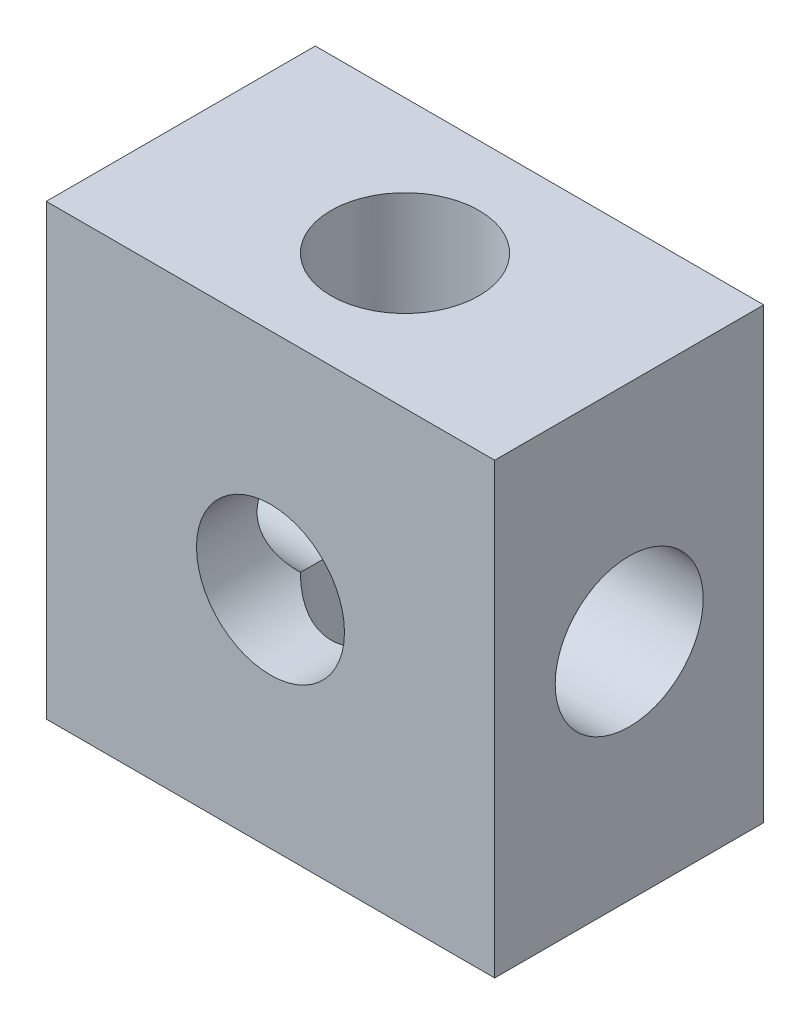
ISO-10303-21;
HEADER;
FILE_DESCRIPTION(('STEP AP214'),'2;1');
FILE_NAME('part.step','',(''),(''),'','','');
FILE_SCHEMA(('AUTOMOTIVE_DESIGN { 1 0 10303 214 1 1 1 1 }'));
ENDSEC;
DATA;
#1=APPLICATION_CONTEXT('core data for automotive mechanical design processes');
#2=APPLICATION_PROTOCOL_DEFINITION('international standard','automotive_design',2000,#1);
#3=PRODUCT_CONTEXT('',#1,'mechanical');
#4=PRODUCT('Part','Part','',(#3));
#5=PRODUCT_RELATED_PRODUCT_CATEGORY('part','',(#4));
#6=PRODUCT_DEFINITION_FORMATION('','',#4);
#7=PRODUCT_DEFINITION_CONTEXT('part definition',#1,'design');
#8=PRODUCT_DEFINITION('design','',#6,#7);
#9=PRODUCT_DEFINITION_SHAPE('','',#8);
#10=(LENGTH_UNIT() NAMED_UNIT(*) SI_UNIT(.MILLI.,.METRE.));
#11=(NAMED_UNIT(*) PLANE_ANGLE_UNIT() SI_UNIT($,.RADIAN.));
#12=(NAMED_UNIT(*) SI_UNIT($,.STERADIAN.) SOLID_ANGLE_UNIT());
#13=UNCERTAINTY_MEASURE_WITH_UNIT(LENGTH_MEASURE(1.E-05),#10,'distance_accuracy_value','');
#14=(GEOMETRIC_REPRESENTATION_CONTEXT(3) GLOBAL_UNCERTAINTY_ASSIGNED_CONTEXT((#13)) GLOBAL_UNIT_ASSIGNED_CONTEXT((#10,
#11,#12)) REPRESENTATION_CONTEXT('',''));
#15=CARTESIAN_POINT('',(0.,0.,0.));
#16=DIRECTION('',(0.,0.,1.));
#17=DIRECTION('',(1.,0.,0.));
#18=AXIS2_PLACEMENT_3D('',#15,#16,#17);
#19=CARTESIAN_POINT('',(0.,0.,0.));
#20=DIRECTION('',(0.,0.,1.));
#21=DIRECTION('',(1.,0.,0.));
#22=AXIS2_PLACEMENT_3D('',#19,#20,#21);
#23=CYLINDRICAL_SURFACE('',#22,1.65);
#24=CARTESIAN_POINT('',(0.,0.,6.));
#25=DIRECTION('',(0.,0.,1.));
#26=DIRECTION('',(1.,0.,0.));
#27=AXIS2_PLACEMENT_3D('',#24,#25,#26);
#28=CIRCLE('',#27,1.65);
#29=CARTESIAN_POINT('',(1.65,0.,6.));
#30=VERTEX_POINT('',#29);
#31=EDGE_CURVE('E141',#30,#30,#28,.T.);
#32=ORIENTED_EDGE('',*,*,#31,.T.);
#33=EDGE_LOOP('',(#32));
#34=FACE_BOUND('',#33,.T.);
#35=CARTESIAN_POINT('',(0.,0.,3.));
#36=DIRECTION('',(-0.707106781186547,0.,0.707106781186547));
#37=DIRECTION('',(0.707106781186547,0.,0.707106781186547));
#38=AXIS2_PLACEMENT_3D('',#35,#36,#37);
#39=ELLIPSE('',#38,2.33345237791561,1.65);
#40=CARTESIAN_POINT('',(1.1667261889578,1.1667261889578,4.1667261889578));
#41=VERTEX_POINT('',#40);
#42=CARTESIAN_POINT('',(1.1667261889578,-1.1667261889578,4.1667261889578));
#43=VERTEX_POINT('',#42);
#44=EDGE_CURVE('E103',#41,#43,#39,.F.);
#45=ORIENTED_EDGE('',*,*,#44,.T.);
#46=CARTESIAN_POINT('',(0.,0.,3.));
#47=DIRECTION('',(0.,0.707106781186547,0.707106781186547));
#48=DIRECTION('',(0.,-0.707106781186547,0.707106781186547));
#49=AXIS2_PLACEMENT_3D('',#46,#47,#48);
#50=ELLIPSE('',#49,2.33345237791561,1.65);
#51=CARTESIAN_POINT('',(-1.1667261889578,-1.1667261889578,4.1667261889578));
#52=VERTEX_POINT('',#51);
#53=EDGE_CURVE('E49',#43,#52,#50,.F.);
#54=ORIENTED_EDGE('',*,*,#53,.T.);
#55=CARTESIAN_POINT('',(0.,0.,3.));
#56=DIRECTION('',(0.707106781186547,0.,0.707106781186547));
#57=DIRECTION('',(-0.707106781186547,0.,0.707106781186547));
#58=AXIS2_PLACEMENT_3D('',#55,#56,#57);
#59=ELLIPSE('',#58,2.33345237791561,1.65);
#60=CARTESIAN_POINT('',(-1.1667261889578,1.1667261889578,4.1667261889578));
#61=VERTEX_POINT('',#60);
#62=EDGE_CURVE('E115',#52,#61,#59,.F.);
#63=ORIENTED_EDGE('',*,*,#62,.T.);
#64=CARTESIAN_POINT('',(0.,0.,3.));
#65=DIRECTION('',(0.,-0.707106781186547,0.707106781186547));
#66=DIRECTION('',(0.,0.707106781186547,0.707106781186547));
#67=AXIS2_PLACEMENT_3D('',#64,#65,#66);
#68=ELLIPSE('',#67,2.33345237791561,1.65);
#69=EDGE_CURVE('E126',#61,#41,#68,.F.);
#70=ORIENTED_EDGE('',*,*,#69,.T.);
#71=EDGE_LOOP('',(#45,#54,#63,#70));
#72=FACE_BOUND('',#71,.T.);
#73=ADVANCED_FACE('F34',(#34,#72),#23,.F.);
#74=CARTESIAN_POINT('',(5.,5.,6.));
#75=DIRECTION('',(-1.,0.,0.));
#76=DIRECTION('',(0.,-1.,0.));
#77=AXIS2_PLACEMENT_3D('',#74,#75,#76);
#78=PLANE('',#77);
#79=CARTESIAN_POINT('',(5.,0.,3.));
#80=DIRECTION('',(-1.,0.,0.));
#81=DIRECTION('',(0.,0.,1.));
#82=AXIS2_PLACEMENT_3D('',#79,#80,#81);
#83=CIRCLE('',#82,1.65);
#84=CARTESIAN_POINT('',(5.,0.,4.65));
#85=VERTEX_POINT('',#84);
#86=EDGE_CURVE('E130',#85,#85,#83,.T.);
#87=ORIENTED_EDGE('',*,*,#86,.T.);
#88=EDGE_LOOP('',(#87));
#89=FACE_BOUND('',#88,.T.);
#90=DIRECTION('',(0.,1.,0.));
#91=VECTOR('',#90,1.);
#92=CARTESIAN_POINT('',(5.,5.,0.));
#93=LINE('',#92,#91);
#94=CARTESIAN_POINT('',(5.,-5.,0.));
#95=VERTEX_POINT('',#94);
#96=CARTESIAN_POINT('',(5.,5.,0.));
#97=VERTEX_POINT('',#96);
#98=EDGE_CURVE('E145',#95,#97,#93,.T.);
#99=ORIENTED_EDGE('',*,*,#98,.T.);
#100=DIRECTION('',(0.,0.,-1.));
#101=VECTOR('',#100,1.);
#102=CARTESIAN_POINT('',(5.,5.,6.));
#103=LINE('',#102,#101);
#104=CARTESIAN_POINT('',(5.,5.,6.));
#105=VERTEX_POINT('',#104);
#106=EDGE_CURVE('E119',#105,#97,#103,.T.);
#107=ORIENTED_EDGE('',*,*,#106,.F.);
#108=DIRECTION('',(0.,1.,0.));
#109=VECTOR('',#108,1.);
#110=CARTESIAN_POINT('',(5.,5.,6.));
#111=LINE('',#110,#109);
#112=CARTESIAN_POINT('',(5.,-5.,6.));
#113=VERTEX_POINT('',#112);
#114=EDGE_CURVE('E148',#113,#105,#111,.T.);
#115=ORIENTED_EDGE('',*,*,#114,.F.);
#116=DIRECTION('',(0.,0.,-1.));
#117=VECTOR('',#116,1.);
#118=CARTESIAN_POINT('',(5.,-5.,6.));
#119=LINE('',#118,#117);
#120=EDGE_CURVE('E158',#113,#95,#119,.T.);
#121=ORIENTED_EDGE('',*,*,#120,.T.);
#122=EDGE_LOOP('',(#99,#107,#115,#121));
#123=FACE_BOUND('',#122,.T.);
#124=ADVANCED_FACE('F36',(#89,#123),#78,.F.);
#125=CARTESIAN_POINT('',(-5.,5.,6.));
#126=DIRECTION('',(0.,-1.,0.));
#127=DIRECTION('',(1.,0.,0.));
#128=AXIS2_PLACEMENT_3D('',#125,#126,#127);
#129=PLANE('',#128);
#130=CARTESIAN_POINT('',(0.,5.,3.));
#131=DIRECTION('',(0.,1.,0.));
#132=DIRECTION('',(-1.,0.,0.));
#133=AXIS2_PLACEMENT_3D('',#130,#131,#132);
#134=CIRCLE('',#133,1.65);
#135=CARTESIAN_POINT('',(-1.65,5.,3.));
#136=VERTEX_POINT('',#135);
#137=EDGE_CURVE('E236',#136,#136,#134,.T.);
#138=ORIENTED_EDGE('',*,*,#137,.F.);
#139=EDGE_LOOP('',(#138));
#140=FACE_BOUND('',#139,.T.);
#141=DIRECTION('',(-1.,0.,0.));
#142=VECTOR('',#141,1.);
#143=CARTESIAN_POINT('',(-5.,5.,0.));
#144=LINE('',#143,#142);
#145=CARTESIAN_POINT('',(-5.,5.,0.));
#146=VERTEX_POINT('',#145);
#147=EDGE_CURVE('E161',#97,#146,#144,.T.);
#148=ORIENTED_EDGE('',*,*,#147,.T.);
#149=DIRECTION('',(0.,0.,-1.));
#150=VECTOR('',#149,1.);
#151=CARTESIAN_POINT('',(-5.,5.,6.));
#152=LINE('',#151,#150);
#153=CARTESIAN_POINT('',(-5.,5.,6.));
#154=VERTEX_POINT('',#153);
#155=EDGE_CURVE('E171',#154,#146,#152,.T.);
#156=ORIENTED_EDGE('',*,*,#155,.F.);
#157=DIRECTION('',(-1.,0.,0.));
#158=VECTOR('',#157,1.);
#159=CARTESIAN_POINT('',(-5.,5.,6.));
#160=LINE('',#159,#158);
#161=EDGE_CURVE('E151',#105,#154,#160,.T.);
#162=ORIENTED_EDGE('',*,*,#161,.F.);
#163=ORIENTED_EDGE('',*,*,#106,.T.);
#164=EDGE_LOOP('',(#148,#156,#162,#163));
#165=FACE_BOUND('',#164,.T.);
#166=ADVANCED_FACE('F176',(#140,#165),#129,.F.);
#167=CARTESIAN_POINT('',(-5.,5.,6.));
#168=DIRECTION('',(1.,0.,0.));
#169=DIRECTION('',(0.,0.,-1.));
#170=AXIS2_PLACEMENT_3D('',#167,#168,#169);
#171=PLANE('',#170);
#172=CARTESIAN_POINT('',(-5.,0.,3.));
#173=DIRECTION('',(1.,0.,0.));
#174=DIRECTION('',(0.,0.,-1.));
#175=AXIS2_PLACEMENT_3D('',#172,#173,#174);
#176=CIRCLE('',#175,1.65);
#177=CARTESIAN_POINT('',(-5.,0.,1.35));
#178=VERTEX_POINT('',#177);
#179=EDGE_CURVE('E138',#178,#178,#176,.T.);
#180=ORIENTED_EDGE('',*,*,#179,.T.);
#181=EDGE_LOOP('',(#180));
#182=FACE_BOUND('',#181,.T.);
#183=DIRECTION('',(0.,-1.,0.));
#184=VECTOR('',#183,1.);
#185=CARTESIAN_POINT('',(-5.,5.,0.));
#186=LINE('',#185,#184);
#187=CARTESIAN_POINT('',(-5.,-5.,0.));
#188=VERTEX_POINT('',#187);
#189=EDGE_CURVE('E163',#146,#188,#186,.T.);
#190=ORIENTED_EDGE('',*,*,#189,.T.);
#191=DIRECTION('',(0.,0.,-1.));
#192=VECTOR('',#191,1.);
#193=CARTESIAN_POINT('',(-5.,-5.,6.));
#194=LINE('',#193,#192);
#195=CARTESIAN_POINT('',(-5.,-5.,6.));
#196=VERTEX_POINT('',#195);
#197=EDGE_CURVE('E168',#196,#188,#194,.T.);
#198=ORIENTED_EDGE('',*,*,#197,.F.);
#199=DIRECTION('',(0.,-1.,0.));
#200=VECTOR('',#199,1.);
#201=CARTESIAN_POINT('',(-5.,5.,6.));
#202=LINE('',#201,#200);
#203=EDGE_CURVE('E154',#154,#196,#202,.T.);
#204=ORIENTED_EDGE('',*,*,#203,.F.);
#205=ORIENTED_EDGE('',*,*,#155,.T.);
#206=EDGE_LOOP('',(#190,#198,#204,#205));
#207=FACE_BOUND('',#206,.T.);
#208=ADVANCED_FACE('F188',(#182,#207),#171,.F.);
#209=CARTESIAN_POINT('',(-5.,-5.,6.));
#210=DIRECTION('',(0.,1.,0.));
#211=DIRECTION('',(-1.,0.,0.));
#212=AXIS2_PLACEMENT_3D('',#209,#210,#211);
#213=PLANE('',#212);
#214=CARTESIAN_POINT('',(0.,-5.,3.));
#215=DIRECTION('',(0.,1.,0.));
#216=DIRECTION('',(-1.,0.,0.));
#217=AXIS2_PLACEMENT_3D('',#214,#215,#216);
#218=CIRCLE('',#217,1.65);
#219=CARTESIAN_POINT('',(-1.65,-5.,3.));
#220=VERTEX_POINT('',#219);
#221=EDGE_CURVE('E112',#220,#220,#218,.T.);
#222=ORIENTED_EDGE('',*,*,#221,.T.);
#223=EDGE_LOOP('',(#222));
#224=FACE_BOUND('',#223,.T.);
#225=DIRECTION('',(1.,0.,0.));
#226=VECTOR('',#225,1.);
#227=CARTESIAN_POINT('',(-5.,-5.,0.));
#228=LINE('',#227,#226);
#229=EDGE_CURVE('E152',#188,#95,#228,.T.);
#230=ORIENTED_EDGE('',*,*,#229,.T.);
#231=ORIENTED_EDGE('',*,*,#120,.F.);
#232=DIRECTION('',(1.,0.,0.));
#233=VECTOR('',#232,1.);
#234=CARTESIAN_POINT('',(-5.,-5.,6.));
#235=LINE('',#234,#233);
#236=EDGE_CURVE('E156',#196,#113,#235,.T.);
#237=ORIENTED_EDGE('',*,*,#236,.F.);
#238=ORIENTED_EDGE('',*,*,#197,.T.);
#239=EDGE_LOOP('',(#230,#231,#237,#238));
#240=FACE_BOUND('',#239,.T.);
#241=ADVANCED_FACE('F192',(#224,#240),#213,.F.);
#242=CARTESIAN_POINT('',(0.,0.,6.));
#243=DIRECTION('',(0.,0.,1.));
#244=DIRECTION('',(1.,0.,0.));
#245=AXIS2_PLACEMENT_3D('',#242,#243,#244);
#246=PLANE('',#245);
#247=ORIENTED_EDGE('',*,*,#31,.F.);
#248=EDGE_LOOP('',(#247));
#249=FACE_BOUND('',#248,.T.);
#250=ORIENTED_EDGE('',*,*,#114,.T.);
#251=ORIENTED_EDGE('',*,*,#161,.T.);
#252=ORIENTED_EDGE('',*,*,#203,.T.);
#253=ORIENTED_EDGE('',*,*,#236,.T.);
#254=EDGE_LOOP('',(#250,#251,#252,#253));
#255=FACE_BOUND('',#254,.T.);
#256=ADVANCED_FACE('F194',(#249,#255),#246,.T.);
#257=CARTESIAN_POINT('',(0.,0.,0.));
#258=DIRECTION('',(0.,0.,1.));
#259=DIRECTION('',(1.,0.,0.));
#260=AXIS2_PLACEMENT_3D('',#257,#258,#259);
#261=PLANE('',#260);
#262=CARTESIAN_POINT('',(0.,0.,0.));
#263=DIRECTION('',(0.,0.,1.));
#264=DIRECTION('',(1.,0.,0.));
#265=AXIS2_PLACEMENT_3D('',#262,#263,#264);
#266=CIRCLE('',#265,1.65);
#267=CARTESIAN_POINT('',(1.65,0.,0.));
#268=VERTEX_POINT('',#267);
#269=EDGE_CURVE('E142',#268,#268,#266,.T.);
#270=ORIENTED_EDGE('',*,*,#269,.T.);
#271=EDGE_LOOP('',(#270));
#272=FACE_BOUND('',#271,.T.);
#273=ORIENTED_EDGE('',*,*,#98,.F.);
#274=ORIENTED_EDGE('',*,*,#229,.F.);
#275=ORIENTED_EDGE('',*,*,#189,.F.);
#276=ORIENTED_EDGE('',*,*,#147,.F.);
#277=EDGE_LOOP('',(#273,#274,#275,#276));
#278=FACE_BOUND('',#277,.T.);
#279=ADVANCED_FACE('F184',(#272,#278),#261,.F.);
#280=CARTESIAN_POINT('',(0.,0.,3.));
#281=DIRECTION('',(0.707106781186547,0.,0.707106781186547));
#282=DIRECTION('',(-0.707106781186547,0.,0.707106781186547));
#283=AXIS2_PLACEMENT_3D('',#280,#281,#282);
#284=ELLIPSE('',#283,2.33345237791561,1.65);
#285=CARTESIAN_POINT('',(1.1667261889578,-1.1667261889578,1.8332738110422));
#286=VERTEX_POINT('',#285);
#287=CARTESIAN_POINT('',(1.1667261889578,1.1667261889578,1.8332738110422));
#288=VERTEX_POINT('',#287);
#289=EDGE_CURVE('E109',#286,#288,#284,.T.);
#290=ORIENTED_EDGE('',*,*,#289,.T.);
#291=CARTESIAN_POINT('',(0.,0.,3.));
#292=DIRECTION('',(0.,0.707106781186547,0.707106781186547));
#293=DIRECTION('',(0.,-0.707106781186547,0.707106781186547));
#294=AXIS2_PLACEMENT_3D('',#291,#292,#293);
#295=ELLIPSE('',#294,2.33345237791561,1.65);
#296=CARTESIAN_POINT('',(-1.1667261889578,1.1667261889578,1.8332738110422));
#297=VERTEX_POINT('',#296);
#298=EDGE_CURVE('E57',#288,#297,#295,.T.);
#299=ORIENTED_EDGE('',*,*,#298,.T.);
#300=CARTESIAN_POINT('',(0.,0.,3.));
#301=DIRECTION('',(-0.707106781186547,0.,0.707106781186547));
#302=DIRECTION('',(0.707106781186547,0.,0.707106781186547));
#303=AXIS2_PLACEMENT_3D('',#300,#301,#302);
#304=ELLIPSE('',#303,2.33345237791561,1.65);
#305=CARTESIAN_POINT('',(-1.1667261889578,-1.1667261889578,1.8332738110422));
#306=VERTEX_POINT('',#305);
#307=EDGE_CURVE('E111',#297,#306,#304,.T.);
#308=ORIENTED_EDGE('',*,*,#307,.T.);
#309=CARTESIAN_POINT('',(0.,0.,3.));
#310=DIRECTION('',(0.,-0.707106781186547,0.707106781186547));
#311=DIRECTION('',(0.,0.707106781186547,0.707106781186547));
#312=AXIS2_PLACEMENT_3D('',#309,#310,#311);
#313=ELLIPSE('',#312,2.33345237791561,1.65);
#314=EDGE_CURVE('E97',#306,#286,#313,.T.);
#315=ORIENTED_EDGE('',*,*,#314,.T.);
#316=EDGE_LOOP('',(#290,#299,#308,#315));
#317=FACE_BOUND('',#316,.T.);
#318=ORIENTED_EDGE('',*,*,#269,.F.);
#319=EDGE_LOOP('',(#318));
#320=FACE_BOUND('',#319,.T.);
#321=ADVANCED_FACE('F107',(#317,#320),#23,.F.);
#322=CARTESIAN_POINT('',(5.,0.,3.));
#323=DIRECTION('',(-1.,0.,0.));
#324=DIRECTION('',(0.,0.,1.));
#325=AXIS2_PLACEMENT_3D('',#322,#323,#324);
#326=CYLINDRICAL_SURFACE('',#325,1.65);
#327=ORIENTED_EDGE('',*,*,#62,.F.);
#328=CARTESIAN_POINT('',(0.,0.,3.));
#329=DIRECTION('',(-0.707106781186547,0.707106781186548,0.));
#330=DIRECTION('',(-0.707106781186548,-0.707106781186547,0.));
#331=AXIS2_PLACEMENT_3D('',#328,#329,#330);
#332=ELLIPSE('',#331,2.33345237791561,1.65);
#333=EDGE_CURVE('E132',#52,#306,#332,.F.);
#334=ORIENTED_EDGE('',*,*,#333,.T.);
#335=ORIENTED_EDGE('',*,*,#307,.F.);
#336=CARTESIAN_POINT('',(0.,0.,3.));
#337=DIRECTION('',(-0.707106781186548,-0.707106781186547,0.));
#338=DIRECTION('',(-0.707106781186547,0.707106781186548,0.));
#339=AXIS2_PLACEMENT_3D('',#336,#337,#338);
#340=ELLIPSE('',#339,2.33345237791561,1.65);
#341=EDGE_CURVE('E128',#297,#61,#340,.F.);
#342=ORIENTED_EDGE('',*,*,#341,.T.);
#343=EDGE_LOOP('',(#327,#334,#335,#342));
#344=FACE_BOUND('',#343,.T.);
#345=ORIENTED_EDGE('',*,*,#179,.F.);
#346=EDGE_LOOP('',(#345));
#347=FACE_BOUND('',#346,.T.);
#348=ADVANCED_FACE('F216',(#344,#347),#326,.F.);
#349=ORIENTED_EDGE('',*,*,#86,.F.);
#350=EDGE_LOOP('',(#349));
#351=FACE_BOUND('',#350,.T.);
#352=ORIENTED_EDGE('',*,*,#44,.F.);
#353=CARTESIAN_POINT('',(0.,0.,3.));
#354=DIRECTION('',(-0.707106781186547,0.707106781186548,0.));
#355=DIRECTION('',(-0.707106781186548,-0.707106781186547,0.));
#356=AXIS2_PLACEMENT_3D('',#353,#354,#355);
#357=ELLIPSE('',#356,2.33345237791561,1.65);
#358=EDGE_CURVE('E11',#41,#288,#357,.T.);
#359=ORIENTED_EDGE('',*,*,#358,.T.);
#360=ORIENTED_EDGE('',*,*,#289,.F.);
#361=CARTESIAN_POINT('',(0.,0.,3.));
#362=DIRECTION('',(-0.707106781186548,-0.707106781186547,0.));
#363=DIRECTION('',(-0.707106781186547,0.707106781186548,0.));
#364=AXIS2_PLACEMENT_3D('',#361,#362,#363);
#365=ELLIPSE('',#364,2.33345237791561,1.65);
#366=EDGE_CURVE('E42',#286,#43,#365,.T.);
#367=ORIENTED_EDGE('',*,*,#366,.T.);
#368=EDGE_LOOP('',(#352,#359,#360,#367));
#369=FACE_BOUND('',#368,.T.);
#370=ADVANCED_FACE('F114',(#351,#369),#326,.F.);
#371=CARTESIAN_POINT('',(0.,-5.,3.));
#372=DIRECTION('',(0.,1.,0.));
#373=DIRECTION('',(-1.,0.,0.));
#374=AXIS2_PLACEMENT_3D('',#371,#372,#373);
#375=CYLINDRICAL_SURFACE('',#374,1.65);
#376=ORIENTED_EDGE('',*,*,#221,.F.);
#377=EDGE_LOOP('',(#376));
#378=FACE_BOUND('',#377,.T.);
#379=ORIENTED_EDGE('',*,*,#53,.F.);
#380=ORIENTED_EDGE('',*,*,#366,.F.);
#381=ORIENTED_EDGE('',*,*,#314,.F.);
#382=ORIENTED_EDGE('',*,*,#333,.F.);
#383=EDGE_LOOP('',(#379,#380,#381,#382));
#384=FACE_BOUND('',#383,.T.);
#385=ADVANCED_FACE('F96',(#378,#384),#375,.F.);
#386=ORIENTED_EDGE('',*,*,#137,.T.);
#387=EDGE_LOOP('',(#386));
#388=FACE_BOUND('',#387,.T.);
#389=ORIENTED_EDGE('',*,*,#298,.F.);
#390=ORIENTED_EDGE('',*,*,#358,.F.);
#391=ORIENTED_EDGE('',*,*,#69,.F.);
#392=ORIENTED_EDGE('',*,*,#341,.F.);
#393=EDGE_LOOP('',(#389,#390,#391,#392));
#394=FACE_BOUND('',#393,.T.);
#395=ADVANCED_FACE('F227',(#388,#394),#375,.F.);
#396=CLOSED_SHELL('',(#73,#124,#166,#208,#241,#256,#279,#321,#348,#370,#385,#395));
#397=MANIFOLD_SOLID_BREP('B2',#396);
#398=ADVANCED_BREP_SHAPE_REPRESENTATION('',(#18,#397),#14);
#399=SHAPE_DEFINITION_REPRESENTATION(#9,#398);
ENDSEC;
END-ISO-10303-21;
